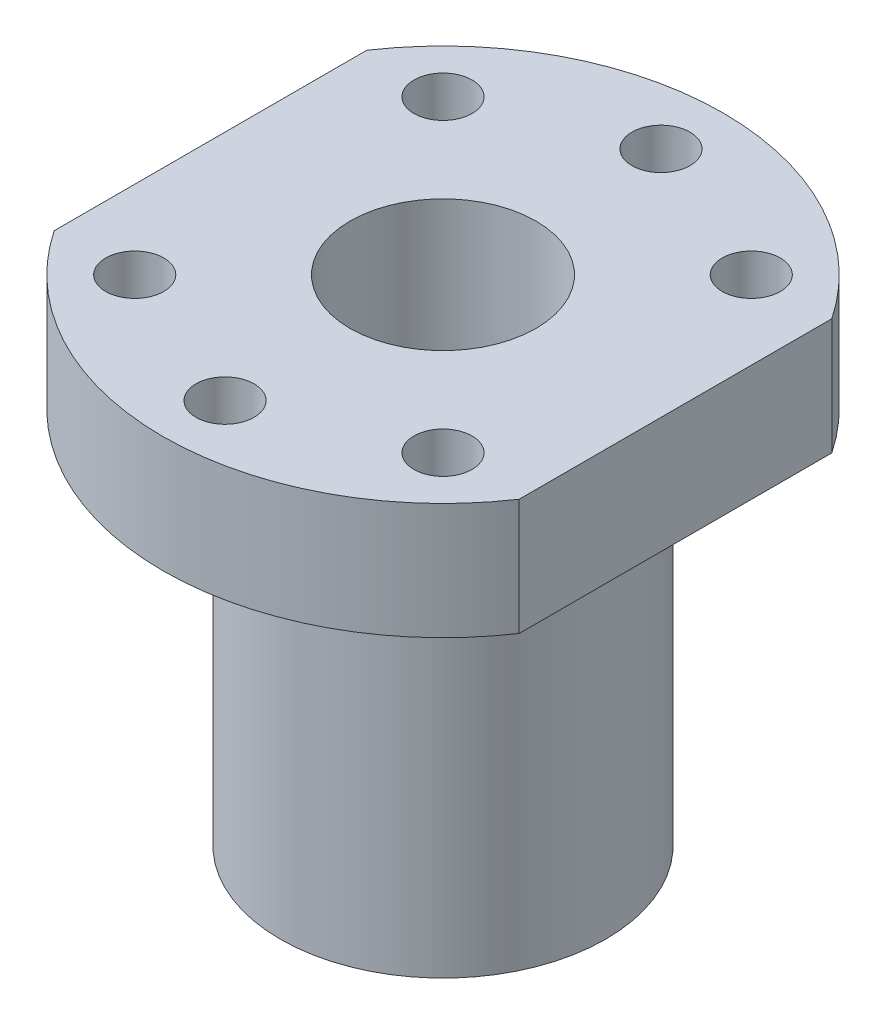
ISO-10303-21;
HEADER;
FILE_DESCRIPTION(('STEP AP214'),'2;1');
FILE_NAME('part.step','',(''),(''),'','','');
FILE_SCHEMA(('AUTOMOTIVE_DESIGN { 1 0 10303 214 1 1 1 1 }'));
ENDSEC;
DATA;
#1=APPLICATION_CONTEXT('core data for automotive mechanical design processes');
#2=APPLICATION_PROTOCOL_DEFINITION('international standard','automotive_design',2000,#1);
#3=PRODUCT_CONTEXT('',#1,'mechanical');
#4=PRODUCT('Part','Part','',(#3));
#5=PRODUCT_RELATED_PRODUCT_CATEGORY('part','',(#4));
#6=PRODUCT_DEFINITION_FORMATION('','',#4);
#7=PRODUCT_DEFINITION_CONTEXT('part definition',#1,'design');
#8=PRODUCT_DEFINITION('design','',#6,#7);
#9=PRODUCT_DEFINITION_SHAPE('','',#8);
#10=(LENGTH_UNIT() NAMED_UNIT(*) SI_UNIT(.MILLI.,.METRE.));
#11=(NAMED_UNIT(*) PLANE_ANGLE_UNIT() SI_UNIT($,.RADIAN.));
#12=(NAMED_UNIT(*) SI_UNIT($,.STERADIAN.) SOLID_ANGLE_UNIT());
#13=UNCERTAINTY_MEASURE_WITH_UNIT(LENGTH_MEASURE(1.E-05),#10,'distance_accuracy_value','');
#14=(GEOMETRIC_REPRESENTATION_CONTEXT(3) GLOBAL_UNCERTAINTY_ASSIGNED_CONTEXT((#13)) GLOBAL_UNIT_ASSIGNED_CONTEXT((#10,
#11,#12)) REPRESENTATION_CONTEXT('',''));
#15=CARTESIAN_POINT('',(0.,0.,0.));
#16=DIRECTION('',(0.,0.,1.));
#17=DIRECTION('',(1.,0.,0.));
#18=AXIS2_PLACEMENT_3D('',#15,#16,#17);
#19=CARTESIAN_POINT('',(20.,10.,0.));
#20=DIRECTION('',(1.,0.,0.));
#21=DIRECTION('',(0.,0.,-1.));
#22=AXIS2_PLACEMENT_3D('',#19,#20,#21);
#23=PLANE('',#22);
#24=DIRECTION('',(0.,0.,1.));
#25=VECTOR('',#24,1.);
#26=CARTESIAN_POINT('',(20.,0.,0.));
#27=LINE('',#26,#25);
#28=CARTESIAN_POINT('',(20.,0.,-13.446560898609));
#29=VERTEX_POINT('',#28);
#30=CARTESIAN_POINT('',(20.,0.,13.446560898609));
#31=VERTEX_POINT('',#30);
#32=EDGE_CURVE('E104',#29,#31,#27,.T.);
#33=ORIENTED_EDGE('',*,*,#32,.F.);
#34=DIRECTION('',(0.,-1.,0.));
#35=VECTOR('',#34,1.);
#36=CARTESIAN_POINT('',(20.,10.,-13.446560898609));
#37=LINE('',#36,#35);
#38=CARTESIAN_POINT('',(20.,10.,-13.446560898609));
#39=VERTEX_POINT('',#38);
#40=EDGE_CURVE('E11',#39,#29,#37,.T.);
#41=ORIENTED_EDGE('',*,*,#40,.F.);
#42=DIRECTION('',(0.,0.,1.));
#43=VECTOR('',#42,1.);
#44=CARTESIAN_POINT('',(20.,10.,0.));
#45=LINE('',#44,#43);
#46=CARTESIAN_POINT('',(20.,10.,13.446560898609));
#47=VERTEX_POINT('',#46);
#48=EDGE_CURVE('E89',#39,#47,#45,.T.);
#49=ORIENTED_EDGE('',*,*,#48,.T.);
#50=DIRECTION('',(0.,-1.,0.));
#51=VECTOR('',#50,1.);
#52=CARTESIAN_POINT('',(20.,10.,13.446560898609));
#53=LINE('',#52,#51);
#54=EDGE_CURVE('E77',#47,#31,#53,.T.);
#55=ORIENTED_EDGE('',*,*,#54,.T.);
#56=EDGE_LOOP('',(#33,#41,#49,#55));
#57=FACE_BOUND('',#56,.T.);
#58=ADVANCED_FACE('F36',(#57),#23,.T.);
#59=CARTESIAN_POINT('',(0.,10.,0.));
#60=DIRECTION('',(0.,-1.,0.));
#61=DIRECTION('',(0.,0.,-1.));
#62=AXIS2_PLACEMENT_3D('',#59,#60,#61);
#63=CYLINDRICAL_SURFACE('',#62,24.1);
#64=CARTESIAN_POINT('',(0.,0.,0.));
#65=DIRECTION('',(0.,1.,0.));
#66=DIRECTION('',(0.,0.,1.));
#67=AXIS2_PLACEMENT_3D('',#64,#65,#66);
#68=CIRCLE('',#67,24.1);
#69=CARTESIAN_POINT('',(-20.,0.,-13.446560898609));
#70=VERTEX_POINT('',#69);
#71=EDGE_CURVE('E94',#29,#70,#68,.T.);
#72=ORIENTED_EDGE('',*,*,#71,.T.);
#73=DIRECTION('',(0.,-1.,0.));
#74=VECTOR('',#73,1.);
#75=CARTESIAN_POINT('',(-20.,10.,-13.446560898609));
#76=LINE('',#75,#74);
#77=CARTESIAN_POINT('',(-20.,10.,-13.446560898609));
#78=VERTEX_POINT('',#77);
#79=EDGE_CURVE('E45',#78,#70,#76,.T.);
#80=ORIENTED_EDGE('',*,*,#79,.F.);
#81=CARTESIAN_POINT('',(0.,10.,0.));
#82=DIRECTION('',(0.,1.,0.));
#83=DIRECTION('',(0.,0.,1.));
#84=AXIS2_PLACEMENT_3D('',#81,#82,#83);
#85=CIRCLE('',#84,24.1);
#86=EDGE_CURVE('E83',#39,#78,#85,.T.);
#87=ORIENTED_EDGE('',*,*,#86,.F.);
#88=ORIENTED_EDGE('',*,*,#40,.T.);
#89=EDGE_LOOP('',(#72,#80,#87,#88));
#90=FACE_BOUND('',#89,.T.);
#91=ADVANCED_FACE('F92',(#90),#63,.T.);
#92=CARTESIAN_POINT('',(-20.,10.,0.));
#93=DIRECTION('',(1.,0.,0.));
#94=DIRECTION('',(0.,0.,-1.));
#95=AXIS2_PLACEMENT_3D('',#92,#93,#94);
#96=PLANE('',#95);
#97=DIRECTION('',(0.,0.,1.));
#98=VECTOR('',#97,1.);
#99=CARTESIAN_POINT('',(-20.,0.,0.));
#100=LINE('',#99,#98);
#101=CARTESIAN_POINT('',(-20.,0.,13.446560898609));
#102=VERTEX_POINT('',#101);
#103=EDGE_CURVE('E70',#70,#102,#100,.T.);
#104=ORIENTED_EDGE('',*,*,#103,.T.);
#105=DIRECTION('',(0.,-1.,0.));
#106=VECTOR('',#105,1.);
#107=CARTESIAN_POINT('',(-20.,10.,13.446560898609));
#108=LINE('',#107,#106);
#109=CARTESIAN_POINT('',(-20.,10.,13.446560898609));
#110=VERTEX_POINT('',#109);
#111=EDGE_CURVE('E95',#110,#102,#108,.T.);
#112=ORIENTED_EDGE('',*,*,#111,.F.);
#113=DIRECTION('',(0.,0.,1.));
#114=VECTOR('',#113,1.);
#115=CARTESIAN_POINT('',(-20.,10.,0.));
#116=LINE('',#115,#114);
#117=EDGE_CURVE('E88',#78,#110,#116,.T.);
#118=ORIENTED_EDGE('',*,*,#117,.F.);
#119=ORIENTED_EDGE('',*,*,#79,.T.);
#120=EDGE_LOOP('',(#104,#112,#118,#119));
#121=FACE_BOUND('',#120,.T.);
#122=ADVANCED_FACE('F97',(#121),#96,.F.);
#123=EDGE_CURVE('E109',#102,#31,#68,.T.);
#124=ORIENTED_EDGE('',*,*,#123,.T.);
#125=ORIENTED_EDGE('',*,*,#54,.F.);
#126=EDGE_CURVE('E54',#110,#47,#85,.T.);
#127=ORIENTED_EDGE('',*,*,#126,.F.);
#128=ORIENTED_EDGE('',*,*,#111,.T.);
#129=EDGE_LOOP('',(#124,#125,#127,#128));
#130=FACE_BOUND('',#129,.T.);
#131=ADVANCED_FACE('F150',(#130),#63,.T.);
#132=CARTESIAN_POINT('',(0.,10.,0.));
#133=DIRECTION('',(0.,-1.,0.));
#134=DIRECTION('',(0.,0.,-1.));
#135=AXIS2_PLACEMENT_3D('',#132,#133,#134);
#136=CYLINDRICAL_SURFACE('',#135,8.);
#137=CARTESIAN_POINT('',(0.,10.,0.));
#138=DIRECTION('',(0.,1.,0.));
#139=DIRECTION('',(0.,0.,1.));
#140=AXIS2_PLACEMENT_3D('',#137,#138,#139);
#141=CIRCLE('',#140,8.);
#142=CARTESIAN_POINT('',(0.,10.,8.));
#143=VERTEX_POINT('',#142);
#144=EDGE_CURVE('E99',#143,#143,#141,.T.);
#145=ORIENTED_EDGE('',*,*,#144,.T.);
#146=EDGE_LOOP('',(#145));
#147=FACE_BOUND('',#146,.T.);
#148=CARTESIAN_POINT('',(0.,-32.5,0.));
#149=DIRECTION('',(0.,1.,0.));
#150=DIRECTION('',(0.,0.,1.));
#151=AXIS2_PLACEMENT_3D('',#148,#149,#150);
#152=CIRCLE('',#151,8.);
#153=CARTESIAN_POINT('',(0.,-32.5,8.));
#154=VERTEX_POINT('',#153);
#155=EDGE_CURVE('E142',#154,#154,#152,.T.);
#156=ORIENTED_EDGE('',*,*,#155,.F.);
#157=EDGE_LOOP('',(#156));
#158=FACE_BOUND('',#157,.T.);
#159=ADVANCED_FACE('F163',(#147,#158),#136,.F.);
#160=CARTESIAN_POINT('',(0.,10.,0.));
#161=DIRECTION('',(0.,1.,0.));
#162=DIRECTION('',(0.,0.,1.));
#163=AXIS2_PLACEMENT_3D('',#160,#161,#162);
#164=PLANE('',#163);
#165=CARTESIAN_POINT('',(-13.2582521472478,10.,13.2582521472477));
#166=DIRECTION('',(0.,1.,0.));
#167=DIRECTION('',(0.,0.,1.));
#168=AXIS2_PLACEMENT_3D('',#165,#166,#167);
#169=CIRCLE('',#168,2.5);
#170=CARTESIAN_POINT('',(-13.2582521472478,10.,15.7582521472477));
#171=VERTEX_POINT('',#170);
#172=EDGE_CURVE('E122',#171,#171,#169,.T.);
#173=ORIENTED_EDGE('',*,*,#172,.F.);
#174=EDGE_LOOP('',(#173));
#175=FACE_BOUND('',#174,.T.);
#176=CARTESIAN_POINT('',(-13.2582521472477,10.,-13.2582521472478));
#177=DIRECTION('',(0.,1.,0.));
#178=DIRECTION('',(0.,0.,1.));
#179=AXIS2_PLACEMENT_3D('',#176,#177,#178);
#180=CIRCLE('',#179,2.5);
#181=CARTESIAN_POINT('',(-13.2582521472477,10.,-10.7582521472478));
#182=VERTEX_POINT('',#181);
#183=EDGE_CURVE('E212',#182,#182,#180,.T.);
#184=ORIENTED_EDGE('',*,*,#183,.F.);
#185=EDGE_LOOP('',(#184));
#186=FACE_BOUND('',#185,.T.);
#187=CARTESIAN_POINT('',(1.30930550206618E-13,10.,-18.75));
#188=DIRECTION('',(0.,1.,0.));
#189=DIRECTION('',(0.,0.,1.));
#190=AXIS2_PLACEMENT_3D('',#187,#188,#189);
#191=CIRCLE('',#190,2.5);
#192=CARTESIAN_POINT('',(1.30930550206618E-13,10.,-16.25));
#193=VERTEX_POINT('',#192);
#194=EDGE_CURVE('E215',#193,#193,#191,.T.);
#195=ORIENTED_EDGE('',*,*,#194,.F.);
#196=EDGE_LOOP('',(#195));
#197=FACE_BOUND('',#196,.T.);
#198=CARTESIAN_POINT('',(13.2582521472479,10.,-13.2582521472477));
#199=DIRECTION('',(0.,1.,0.));
#200=DIRECTION('',(0.,0.,1.));
#201=AXIS2_PLACEMENT_3D('',#198,#199,#200);
#202=CIRCLE('',#201,2.5);
#203=CARTESIAN_POINT('',(13.2582521472479,10.,-10.7582521472477));
#204=VERTEX_POINT('',#203);
#205=EDGE_CURVE('E219',#204,#204,#202,.T.);
#206=ORIENTED_EDGE('',*,*,#205,.F.);
#207=EDGE_LOOP('',(#206));
#208=FACE_BOUND('',#207,.T.);
#209=CARTESIAN_POINT('',(13.2582521472476,10.,13.2582521472479));
#210=DIRECTION('',(0.,1.,0.));
#211=DIRECTION('',(0.,0.,1.));
#212=AXIS2_PLACEMENT_3D('',#209,#210,#211);
#213=CIRCLE('',#212,2.5);
#214=CARTESIAN_POINT('',(13.2582521472476,10.,15.7582521472479));
#215=VERTEX_POINT('',#214);
#216=EDGE_CURVE('E140',#215,#215,#213,.T.);
#217=ORIENTED_EDGE('',*,*,#216,.F.);
#218=EDGE_LOOP('',(#217));
#219=FACE_BOUND('',#218,.T.);
#220=CARTESIAN_POINT('',(0.,10.,18.75));
#221=DIRECTION('',(0.,1.,0.));
#222=DIRECTION('',(0.,0.,1.));
#223=AXIS2_PLACEMENT_3D('',#220,#221,#222);
#224=CIRCLE('',#223,2.5);
#225=CARTESIAN_POINT('',(0.,10.,21.25));
#226=VERTEX_POINT('',#225);
#227=EDGE_CURVE('E117',#226,#226,#224,.T.);
#228=ORIENTED_EDGE('',*,*,#227,.F.);
#229=EDGE_LOOP('',(#228));
#230=FACE_BOUND('',#229,.T.);
#231=ORIENTED_EDGE('',*,*,#48,.F.);
#232=ORIENTED_EDGE('',*,*,#86,.T.);
#233=ORIENTED_EDGE('',*,*,#117,.T.);
#234=ORIENTED_EDGE('',*,*,#126,.T.);
#235=EDGE_LOOP('',(#231,#232,#233,#234));
#236=FACE_BOUND('',#235,.T.);
#237=ORIENTED_EDGE('',*,*,#144,.F.);
#238=EDGE_LOOP('',(#237));
#239=FACE_BOUND('',#238,.T.);
#240=ADVANCED_FACE('F85',(#175,#186,#197,#208,#219,#230,#236,#239),#164,.T.);
#241=CARTESIAN_POINT('',(0.,0.,0.));
#242=DIRECTION('',(0.,1.,0.));
#243=DIRECTION('',(0.,0.,1.));
#244=AXIS2_PLACEMENT_3D('',#241,#242,#243);
#245=PLANE('',#244);
#246=CARTESIAN_POINT('',(-13.2582521472478,0.,13.2582521472477));
#247=DIRECTION('',(0.,1.,0.));
#248=DIRECTION('',(0.,0.,1.));
#249=AXIS2_PLACEMENT_3D('',#246,#247,#248);
#250=CIRCLE('',#249,2.5);
#251=CARTESIAN_POINT('',(-13.2582521472478,0.,15.7582521472477));
#252=VERTEX_POINT('',#251);
#253=EDGE_CURVE('E39',#252,#252,#250,.T.);
#254=ORIENTED_EDGE('',*,*,#253,.T.);
#255=EDGE_LOOP('',(#254));
#256=FACE_BOUND('',#255,.T.);
#257=CARTESIAN_POINT('',(-13.2582521472477,0.,-13.2582521472478));
#258=DIRECTION('',(0.,1.,0.));
#259=DIRECTION('',(0.,0.,1.));
#260=AXIS2_PLACEMENT_3D('',#257,#258,#259);
#261=CIRCLE('',#260,2.5);
#262=CARTESIAN_POINT('',(-13.2582521472477,0.,-10.7582521472478));
#263=VERTEX_POINT('',#262);
#264=EDGE_CURVE('E127',#263,#263,#261,.T.);
#265=ORIENTED_EDGE('',*,*,#264,.T.);
#266=EDGE_LOOP('',(#265));
#267=FACE_BOUND('',#266,.T.);
#268=CARTESIAN_POINT('',(1.30930550206618E-13,0.,-18.75));
#269=DIRECTION('',(0.,1.,0.));
#270=DIRECTION('',(0.,0.,1.));
#271=AXIS2_PLACEMENT_3D('',#268,#269,#270);
#272=CIRCLE('',#271,2.5);
#273=CARTESIAN_POINT('',(1.30930550206618E-13,0.,-16.25));
#274=VERTEX_POINT('',#273);
#275=EDGE_CURVE('E125',#274,#274,#272,.T.);
#276=ORIENTED_EDGE('',*,*,#275,.T.);
#277=EDGE_LOOP('',(#276));
#278=FACE_BOUND('',#277,.T.);
#279=CARTESIAN_POINT('',(13.2582521472479,0.,-13.2582521472477));
#280=DIRECTION('',(0.,1.,0.));
#281=DIRECTION('',(0.,0.,1.));
#282=AXIS2_PLACEMENT_3D('',#279,#280,#281);
#283=CIRCLE('',#282,2.5);
#284=CARTESIAN_POINT('',(13.2582521472479,0.,-10.7582521472477));
#285=VERTEX_POINT('',#284);
#286=EDGE_CURVE('E121',#285,#285,#283,.T.);
#287=ORIENTED_EDGE('',*,*,#286,.T.);
#288=EDGE_LOOP('',(#287));
#289=FACE_BOUND('',#288,.T.);
#290=CARTESIAN_POINT('',(13.2582521472476,0.,13.2582521472479));
#291=DIRECTION('',(0.,1.,0.));
#292=DIRECTION('',(0.,0.,1.));
#293=AXIS2_PLACEMENT_3D('',#290,#291,#292);
#294=CIRCLE('',#293,2.5);
#295=CARTESIAN_POINT('',(13.2582521472476,0.,15.7582521472479));
#296=VERTEX_POINT('',#295);
#297=EDGE_CURVE('E118',#296,#296,#294,.T.);
#298=ORIENTED_EDGE('',*,*,#297,.T.);
#299=EDGE_LOOP('',(#298));
#300=FACE_BOUND('',#299,.T.);
#301=CARTESIAN_POINT('',(0.,0.,18.75));
#302=DIRECTION('',(0.,1.,0.));
#303=DIRECTION('',(0.,0.,1.));
#304=AXIS2_PLACEMENT_3D('',#301,#302,#303);
#305=CIRCLE('',#304,2.5);
#306=CARTESIAN_POINT('',(0.,0.,21.25));
#307=VERTEX_POINT('',#306);
#308=EDGE_CURVE('E113',#307,#307,#305,.T.);
#309=ORIENTED_EDGE('',*,*,#308,.T.);
#310=EDGE_LOOP('',(#309));
#311=FACE_BOUND('',#310,.T.);
#312=CARTESIAN_POINT('',(0.,0.,0.));
#313=DIRECTION('',(0.,1.,0.));
#314=DIRECTION('',(0.,0.,1.));
#315=AXIS2_PLACEMENT_3D('',#312,#313,#314);
#316=CIRCLE('',#315,14.);
#317=CARTESIAN_POINT('',(0.,0.,14.));
#318=VERTEX_POINT('',#317);
#319=EDGE_CURVE('E116',#318,#318,#316,.T.);
#320=ORIENTED_EDGE('',*,*,#319,.T.);
#321=EDGE_LOOP('',(#320));
#322=FACE_BOUND('',#321,.T.);
#323=ORIENTED_EDGE('',*,*,#32,.T.);
#324=ORIENTED_EDGE('',*,*,#123,.F.);
#325=ORIENTED_EDGE('',*,*,#103,.F.);
#326=ORIENTED_EDGE('',*,*,#71,.F.);
#327=EDGE_LOOP('',(#323,#324,#325,#326));
#328=FACE_BOUND('',#327,.T.);
#329=ADVANCED_FACE('F152',(#256,#267,#278,#289,#300,#311,#322,#328),#245,.F.);
#330=CARTESIAN_POINT('',(0.,-32.5,0.));
#331=DIRECTION('',(0.,1.,0.));
#332=DIRECTION('',(0.,0.,1.));
#333=AXIS2_PLACEMENT_3D('',#330,#331,#332);
#334=CYLINDRICAL_SURFACE('',#333,14.);
#335=CARTESIAN_POINT('',(0.,-32.5,0.));
#336=DIRECTION('',(0.,1.,0.));
#337=DIRECTION('',(0.,0.,1.));
#338=AXIS2_PLACEMENT_3D('',#335,#336,#337);
#339=CIRCLE('',#338,14.);
#340=CARTESIAN_POINT('',(0.,-32.5,14.));
#341=VERTEX_POINT('',#340);
#342=EDGE_CURVE('E107',#341,#341,#339,.T.);
#343=ORIENTED_EDGE('',*,*,#342,.T.);
#344=EDGE_LOOP('',(#343));
#345=FACE_BOUND('',#344,.T.);
#346=ORIENTED_EDGE('',*,*,#319,.F.);
#347=EDGE_LOOP('',(#346));
#348=FACE_BOUND('',#347,.T.);
#349=ADVANCED_FACE('F176',(#345,#348),#334,.T.);
#350=CARTESIAN_POINT('',(0.,-32.5,0.));
#351=DIRECTION('',(0.,1.,0.));
#352=DIRECTION('',(0.,0.,1.));
#353=AXIS2_PLACEMENT_3D('',#350,#351,#352);
#354=PLANE('',#353);
#355=ORIENTED_EDGE('',*,*,#155,.T.);
#356=EDGE_LOOP('',(#355));
#357=FACE_BOUND('',#356,.T.);
#358=ORIENTED_EDGE('',*,*,#342,.F.);
#359=EDGE_LOOP('',(#358));
#360=FACE_BOUND('',#359,.T.);
#361=ADVANCED_FACE('F180',(#357,#360),#354,.F.);
#362=CARTESIAN_POINT('',(0.,-22.5,18.75));
#363=DIRECTION('',(0.,1.,0.));
#364=DIRECTION('',(0.,0.,1.));
#365=AXIS2_PLACEMENT_3D('',#362,#363,#364);
#366=CYLINDRICAL_SURFACE('',#365,2.5);
#367=ORIENTED_EDGE('',*,*,#227,.T.);
#368=EDGE_LOOP('',(#367));
#369=FACE_BOUND('',#368,.T.);
#370=ORIENTED_EDGE('',*,*,#308,.F.);
#371=EDGE_LOOP('',(#370));
#372=FACE_BOUND('',#371,.T.);
#373=ADVANCED_FACE('F184',(#369,#372),#366,.F.);
#374=CARTESIAN_POINT('',(13.2582521472476,-22.5,13.2582521472479));
#375=DIRECTION('',(0.,1.,0.));
#376=DIRECTION('',(0.,0.,1.));
#377=AXIS2_PLACEMENT_3D('',#374,#375,#376);
#378=CYLINDRICAL_SURFACE('',#377,2.5);
#379=ORIENTED_EDGE('',*,*,#216,.T.);
#380=EDGE_LOOP('',(#379));
#381=FACE_BOUND('',#380,.T.);
#382=ORIENTED_EDGE('',*,*,#297,.F.);
#383=EDGE_LOOP('',(#382));
#384=FACE_BOUND('',#383,.T.);
#385=ADVANCED_FACE('F188',(#381,#384),#378,.F.);
#386=CARTESIAN_POINT('',(13.2582521472479,-22.5,-13.2582521472477));
#387=DIRECTION('',(0.,1.,0.));
#388=DIRECTION('',(0.,0.,1.));
#389=AXIS2_PLACEMENT_3D('',#386,#387,#388);
#390=CYLINDRICAL_SURFACE('',#389,2.5);
#391=ORIENTED_EDGE('',*,*,#205,.T.);
#392=EDGE_LOOP('',(#391));
#393=FACE_BOUND('',#392,.T.);
#394=ORIENTED_EDGE('',*,*,#286,.F.);
#395=EDGE_LOOP('',(#394));
#396=FACE_BOUND('',#395,.T.);
#397=ADVANCED_FACE('F191',(#393,#396),#390,.F.);
#398=CARTESIAN_POINT('',(1.30930550206618E-13,-22.5,-18.75));
#399=DIRECTION('',(0.,1.,0.));
#400=DIRECTION('',(0.,0.,1.));
#401=AXIS2_PLACEMENT_3D('',#398,#399,#400);
#402=CYLINDRICAL_SURFACE('',#401,2.5);
#403=ORIENTED_EDGE('',*,*,#194,.T.);
#404=EDGE_LOOP('',(#403));
#405=FACE_BOUND('',#404,.T.);
#406=ORIENTED_EDGE('',*,*,#275,.F.);
#407=EDGE_LOOP('',(#406));
#408=FACE_BOUND('',#407,.T.);
#409=ADVANCED_FACE('F195',(#405,#408),#402,.F.);
#410=CARTESIAN_POINT('',(-13.2582521472477,-22.5,-13.2582521472478));
#411=DIRECTION('',(0.,1.,0.));
#412=DIRECTION('',(0.,0.,1.));
#413=AXIS2_PLACEMENT_3D('',#410,#411,#412);
#414=CYLINDRICAL_SURFACE('',#413,2.5);
#415=ORIENTED_EDGE('',*,*,#183,.T.);
#416=EDGE_LOOP('',(#415));
#417=FACE_BOUND('',#416,.T.);
#418=ORIENTED_EDGE('',*,*,#264,.F.);
#419=EDGE_LOOP('',(#418));
#420=FACE_BOUND('',#419,.T.);
#421=ADVANCED_FACE('F199',(#417,#420),#414,.F.);
#422=CARTESIAN_POINT('',(-13.2582521472478,-22.5,13.2582521472477));
#423=DIRECTION('',(0.,1.,0.));
#424=DIRECTION('',(0.,0.,1.));
#425=AXIS2_PLACEMENT_3D('',#422,#423,#424);
#426=CYLINDRICAL_SURFACE('',#425,2.5);
#427=ORIENTED_EDGE('',*,*,#172,.T.);
#428=EDGE_LOOP('',(#427));
#429=FACE_BOUND('',#428,.T.);
#430=ORIENTED_EDGE('',*,*,#253,.F.);
#431=EDGE_LOOP('',(#430));
#432=FACE_BOUND('',#431,.T.);
#433=ADVANCED_FACE('F203',(#429,#432),#426,.F.);
#434=CLOSED_SHELL('',(#58,#91,#122,#131,#159,#240,#329,#349,#361,#373,#385,#397,#409,#421,#433));
#435=MANIFOLD_SOLID_BREP('B2',#434);
#436=ADVANCED_BREP_SHAPE_REPRESENTATION('',(#18,#435),#14);
#437=SHAPE_DEFINITION_REPRESENTATION(#9,#436);
ENDSEC;
END-ISO-10303-21;
